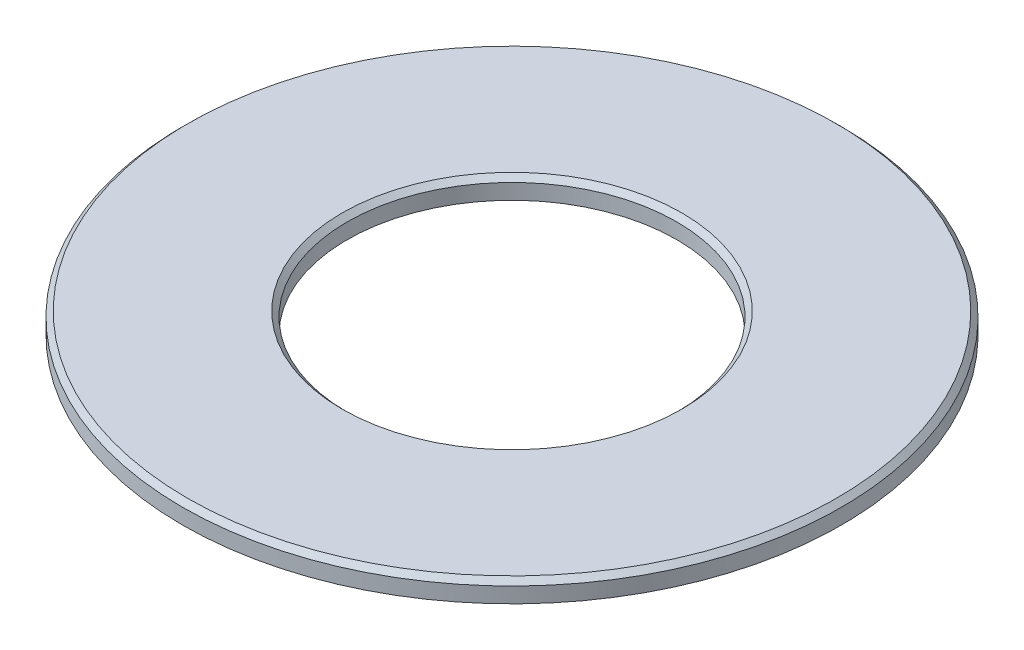
ISO-10303-21;
HEADER;
FILE_DESCRIPTION(('STEP AP214'),'2;1');
FILE_NAME('part.step','',(''),(''),'','','');
FILE_SCHEMA(('AUTOMOTIVE_DESIGN { 1 0 10303 214 1 1 1 1 }'));
ENDSEC;
DATA;
#1=APPLICATION_CONTEXT('core data for automotive mechanical design processes');
#2=APPLICATION_PROTOCOL_DEFINITION('international standard','automotive_design',2000,#1);
#3=PRODUCT_CONTEXT('',#1,'mechanical');
#4=PRODUCT('Part','Part','',(#3));
#5=PRODUCT_RELATED_PRODUCT_CATEGORY('part','',(#4));
#6=PRODUCT_DEFINITION_FORMATION('','',#4);
#7=PRODUCT_DEFINITION_CONTEXT('part definition',#1,'design');
#8=PRODUCT_DEFINITION('design','',#6,#7);
#9=PRODUCT_DEFINITION_SHAPE('','',#8);
#10=(LENGTH_UNIT() NAMED_UNIT(*) SI_UNIT(.MILLI.,.METRE.));
#11=(NAMED_UNIT(*) PLANE_ANGLE_UNIT() SI_UNIT($,.RADIAN.));
#12=(NAMED_UNIT(*) SI_UNIT($,.STERADIAN.) SOLID_ANGLE_UNIT());
#13=UNCERTAINTY_MEASURE_WITH_UNIT(LENGTH_MEASURE(1.E-05),#10,'distance_accuracy_value','');
#14=(GEOMETRIC_REPRESENTATION_CONTEXT(3) GLOBAL_UNCERTAINTY_ASSIGNED_CONTEXT((#13)) GLOBAL_UNIT_ASSIGNED_CONTEXT((#10,
#11,#12)) REPRESENTATION_CONTEXT('',''));
#15=CARTESIAN_POINT('',(0.,0.,0.));
#16=DIRECTION('',(0.,0.,1.));
#17=DIRECTION('',(1.,0.,0.));
#18=AXIS2_PLACEMENT_3D('',#15,#16,#17);
#19=CARTESIAN_POINT('',(3.2,0.2,0.));
#20=DIRECTION('',(0.,1.,0.));
#21=DIRECTION('',(0.,0.,1.));
#22=AXIS2_PLACEMENT_3D('',#19,#20,#21);
#23=PLANE('',#22);
#24=CARTESIAN_POINT('',(0.,0.2,0.));
#25=DIRECTION('',(0.,1.,0.));
#26=DIRECTION('',(0.,0.,1.));
#27=AXIS2_PLACEMENT_3D('',#24,#25,#26);
#28=CIRCLE('',#27,3.15);
#29=CARTESIAN_POINT('',(0.,0.2,3.15));
#30=VERTEX_POINT('',#29);
#31=EDGE_CURVE('E43',#30,#30,#28,.T.);
#32=ORIENTED_EDGE('',*,*,#31,.T.);
#33=EDGE_LOOP('',(#32));
#34=FACE_BOUND('',#33,.T.);
#35=CARTESIAN_POINT('',(0.,0.2,0.));
#36=DIRECTION('',(0.,1.,0.));
#37=DIRECTION('',(0.,0.,1.));
#38=AXIS2_PLACEMENT_3D('',#35,#36,#37);
#39=CIRCLE('',#38,1.65);
#40=CARTESIAN_POINT('',(0.,0.2,1.65));
#41=VERTEX_POINT('',#40);
#42=EDGE_CURVE('E50',#41,#41,#39,.F.);
#43=ORIENTED_EDGE('',*,*,#42,.T.);
#44=EDGE_LOOP('',(#43));
#45=FACE_BOUND('',#44,.T.);
#46=ADVANCED_FACE('F35',(#34,#45),#23,.T.);
#47=CARTESIAN_POINT('',(0.,0.,0.));
#48=DIRECTION('',(0.,-1.,0.));
#49=DIRECTION('',(0.,0.,-1.));
#50=AXIS2_PLACEMENT_3D('',#47,#48,#49);
#51=CYLINDRICAL_SURFACE('',#50,1.6);
#52=CARTESIAN_POINT('',(0.,0.149999999999999,0.));
#53=DIRECTION('',(0.,1.,0.));
#54=DIRECTION('',(0.,0.,1.));
#55=AXIS2_PLACEMENT_3D('',#52,#53,#54);
#56=CIRCLE('',#55,1.6);
#57=CARTESIAN_POINT('',(0.,0.149999999999999,1.6));
#58=VERTEX_POINT('',#57);
#59=EDGE_CURVE('E10',#58,#58,#56,.T.);
#60=ORIENTED_EDGE('',*,*,#59,.T.);
#61=EDGE_LOOP('',(#60));
#62=FACE_BOUND('',#61,.T.);
#63=CARTESIAN_POINT('',(0.,0.,0.));
#64=DIRECTION('',(0.,-1.,0.));
#65=DIRECTION('',(0.,0.,-1.));
#66=AXIS2_PLACEMENT_3D('',#63,#64,#65);
#67=CIRCLE('',#66,1.6);
#68=CARTESIAN_POINT('',(0.,0.,-1.6));
#69=VERTEX_POINT('',#68);
#70=EDGE_CURVE('E60',#69,#69,#67,.T.);
#71=ORIENTED_EDGE('',*,*,#70,.T.);
#72=EDGE_LOOP('',(#71));
#73=FACE_BOUND('',#72,.T.);
#74=ADVANCED_FACE('F81',(#62,#73),#51,.F.);
#75=CARTESIAN_POINT('',(1.6,0.,0.));
#76=DIRECTION('',(0.,-1.,0.));
#77=DIRECTION('',(0.,0.,-1.));
#78=AXIS2_PLACEMENT_3D('',#75,#76,#77);
#79=PLANE('',#78);
#80=CARTESIAN_POINT('',(0.,0.,0.));
#81=DIRECTION('',(0.,-1.,0.));
#82=DIRECTION('',(0.,0.,-1.));
#83=AXIS2_PLACEMENT_3D('',#80,#81,#82);
#84=CIRCLE('',#83,3.2);
#85=CARTESIAN_POINT('',(0.,0.,-3.2));
#86=VERTEX_POINT('',#85);
#87=EDGE_CURVE('E63',#86,#86,#84,.T.);
#88=ORIENTED_EDGE('',*,*,#87,.T.);
#89=EDGE_LOOP('',(#88));
#90=FACE_BOUND('',#89,.T.);
#91=ORIENTED_EDGE('',*,*,#70,.F.);
#92=EDGE_LOOP('',(#91));
#93=FACE_BOUND('',#92,.T.);
#94=ADVANCED_FACE('F68',(#90,#93),#79,.T.);
#95=CARTESIAN_POINT('',(0.,0.,0.));
#96=DIRECTION('',(0.,-1.,0.));
#97=DIRECTION('',(0.,0.,-1.));
#98=AXIS2_PLACEMENT_3D('',#95,#96,#97);
#99=CYLINDRICAL_SURFACE('',#98,3.2);
#100=CARTESIAN_POINT('',(0.,0.150000000000001,0.));
#101=DIRECTION('',(0.,1.,0.));
#102=DIRECTION('',(0.,0.,1.));
#103=AXIS2_PLACEMENT_3D('',#100,#101,#102);
#104=CIRCLE('',#103,3.2);
#105=CARTESIAN_POINT('',(0.,0.150000000000001,3.2));
#106=VERTEX_POINT('',#105);
#107=EDGE_CURVE('E55',#106,#106,#104,.F.);
#108=ORIENTED_EDGE('',*,*,#107,.T.);
#109=EDGE_LOOP('',(#108));
#110=FACE_BOUND('',#109,.T.);
#111=ORIENTED_EDGE('',*,*,#87,.F.);
#112=EDGE_LOOP('',(#111));
#113=FACE_BOUND('',#112,.T.);
#114=ADVANCED_FACE('F71',(#110,#113),#99,.T.);
#115=CARTESIAN_POINT('',(0.,0.150000000000001,0.));
#116=DIRECTION('',(0.,-1.,0.));
#117=DIRECTION('',(0.,0.,-1.));
#118=AXIS2_PLACEMENT_3D('',#115,#116,#117);
#119=CONICAL_SURFACE('',#118,3.2,0.785398163397457);
#120=ORIENTED_EDGE('',*,*,#31,.F.);
#121=EDGE_LOOP('',(#120));
#122=FACE_BOUND('',#121,.T.);
#123=ORIENTED_EDGE('',*,*,#107,.F.);
#124=EDGE_LOOP('',(#123));
#125=FACE_BOUND('',#124,.T.);
#126=ADVANCED_FACE('F73',(#122,#125),#119,.T.);
#127=CARTESIAN_POINT('',(0.,0.2,0.));
#128=DIRECTION('',(0.,1.,0.));
#129=DIRECTION('',(0.,0.,1.));
#130=AXIS2_PLACEMENT_3D('',#127,#128,#129);
#131=CONICAL_SURFACE('',#130,1.65,0.785398163397448);
#132=ORIENTED_EDGE('',*,*,#59,.F.);
#133=EDGE_LOOP('',(#132));
#134=FACE_BOUND('',#133,.T.);
#135=ORIENTED_EDGE('',*,*,#42,.F.);
#136=EDGE_LOOP('',(#135));
#137=FACE_BOUND('',#136,.T.);
#138=ADVANCED_FACE('F37',(#134,#137),#131,.F.);
#139=CLOSED_SHELL('',(#46,#74,#94,#114,#126,#138));
#140=MANIFOLD_SOLID_BREP('B2',#139);
#141=ADVANCED_BREP_SHAPE_REPRESENTATION('',(#18,#140),#14);
#142=SHAPE_DEFINITION_REPRESENTATION(#9,#141);
ENDSEC;
END-ISO-10303-21;
